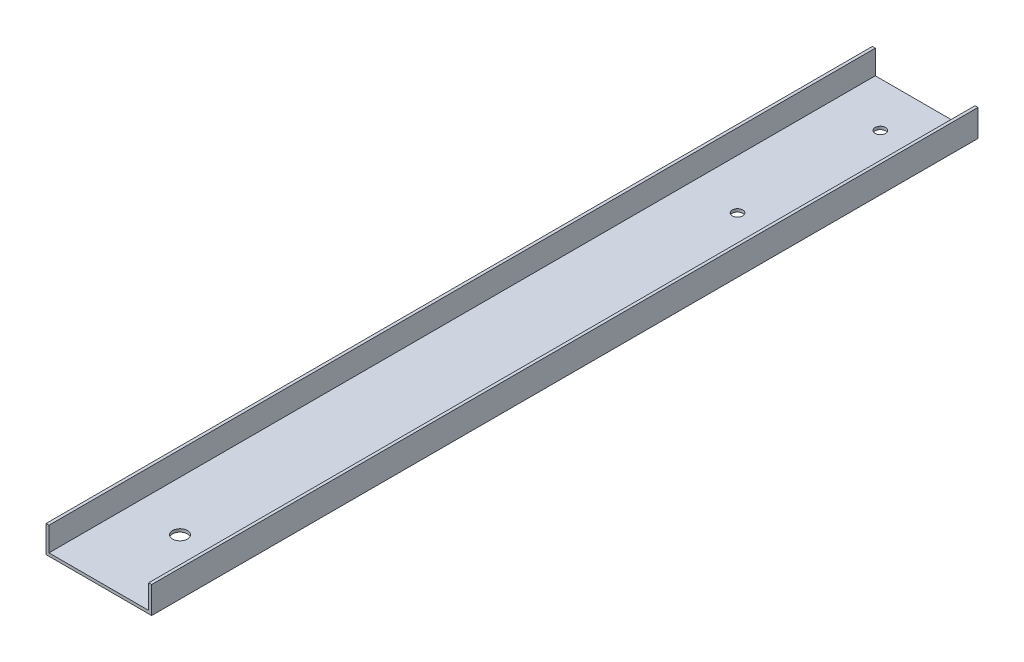
ISO-10303-21;
HEADER;
FILE_DESCRIPTION(('STEP AP214'),'2;1');
FILE_NAME('part.step','',(''),(''),'','','');
FILE_SCHEMA(('AUTOMOTIVE_DESIGN { 1 0 10303 214 1 1 1 1 }'));
ENDSEC;
DATA;
#1=APPLICATION_CONTEXT('core data for automotive mechanical design processes');
#2=APPLICATION_PROTOCOL_DEFINITION('international standard','automotive_design',2000,#1);
#3=PRODUCT_CONTEXT('',#1,'mechanical');
#4=PRODUCT('Part','Part','',(#3));
#5=PRODUCT_RELATED_PRODUCT_CATEGORY('part','',(#4));
#6=PRODUCT_DEFINITION_FORMATION('','',#4);
#7=PRODUCT_DEFINITION_CONTEXT('part definition',#1,'design');
#8=PRODUCT_DEFINITION('design','',#6,#7);
#9=PRODUCT_DEFINITION_SHAPE('','',#8);
#10=(LENGTH_UNIT() NAMED_UNIT(*) SI_UNIT(.MILLI.,.METRE.));
#11=(NAMED_UNIT(*) PLANE_ANGLE_UNIT() SI_UNIT($,.RADIAN.));
#12=(NAMED_UNIT(*) SI_UNIT($,.STERADIAN.) SOLID_ANGLE_UNIT());
#13=UNCERTAINTY_MEASURE_WITH_UNIT(LENGTH_MEASURE(1.E-05),#10,'distance_accuracy_value','');
#14=(GEOMETRIC_REPRESENTATION_CONTEXT(3) GLOBAL_UNCERTAINTY_ASSIGNED_CONTEXT((#13)) GLOBAL_UNIT_ASSIGNED_CONTEXT((#10,
#11,#12)) REPRESENTATION_CONTEXT('',''));
#15=CARTESIAN_POINT('',(0.,0.,0.));
#16=DIRECTION('',(0.,0.,1.));
#17=DIRECTION('',(1.,0.,0.));
#18=AXIS2_PLACEMENT_3D('',#15,#16,#17);
#19=CARTESIAN_POINT('',(1.27,0.,354.0125));
#20=DIRECTION('',(0.,-1.,0.));
#21=DIRECTION('',(0.,0.,-1.));
#22=AXIS2_PLACEMENT_3D('',#19,#20,#21);
#23=PLANE('',#22);
#24=DIRECTION('',(-1.,0.,0.));
#25=VECTOR('',#24,1.);
#26=CARTESIAN_POINT('',(1.27,0.,0.));
#27=LINE('',#26,#25);
#28=CARTESIAN_POINT('',(1.27,0.,0.));
#29=VERTEX_POINT('',#28);
#30=CARTESIAN_POINT('',(0.,0.,0.));
#31=VERTEX_POINT('',#30);
#32=EDGE_CURVE('E130',#29,#31,#27,.T.);
#33=ORIENTED_EDGE('',*,*,#32,.T.);
#34=DIRECTION('',(0.,0.,-1.));
#35=VECTOR('',#34,1.);
#36=CARTESIAN_POINT('',(0.,0.,354.0125));
#37=LINE('',#36,#35);
#38=CARTESIAN_POINT('',(0.,0.,354.0125));
#39=VERTEX_POINT('',#38);
#40=EDGE_CURVE('E11',#39,#31,#37,.T.);
#41=ORIENTED_EDGE('',*,*,#40,.F.);
#42=DIRECTION('',(-1.,0.,0.));
#43=VECTOR('',#42,1.);
#44=CARTESIAN_POINT('',(1.27,0.,354.0125));
#45=LINE('',#44,#43);
#46=CARTESIAN_POINT('',(1.27,0.,354.0125));
#47=VERTEX_POINT('',#46);
#48=EDGE_CURVE('E145',#47,#39,#45,.T.);
#49=ORIENTED_EDGE('',*,*,#48,.F.);
#50=DIRECTION('',(0.,0.,-1.));
#51=VECTOR('',#50,1.);
#52=CARTESIAN_POINT('',(1.27,0.,354.0125));
#53=LINE('',#52,#51);
#54=EDGE_CURVE('E126',#47,#29,#53,.T.);
#55=ORIENTED_EDGE('',*,*,#54,.T.);
#56=EDGE_LOOP('',(#33,#41,#49,#55));
#57=FACE_BOUND('',#56,.T.);
#58=ADVANCED_FACE('F34',(#57),#23,.F.);
#59=CARTESIAN_POINT('',(0.,0.,354.0125));
#60=DIRECTION('',(1.,0.,0.));
#61=DIRECTION('',(0.,1.,0.));
#62=AXIS2_PLACEMENT_3D('',#59,#60,#61);
#63=PLANE('',#62);
#64=DIRECTION('',(0.,-1.,0.));
#65=VECTOR('',#64,1.);
#66=CARTESIAN_POINT('',(0.,0.,0.));
#67=LINE('',#66,#65);
#68=CARTESIAN_POINT('',(0.,-11.5316,0.));
#69=VERTEX_POINT('',#68);
#70=EDGE_CURVE('E133',#31,#69,#67,.T.);
#71=ORIENTED_EDGE('',*,*,#70,.T.);
#72=DIRECTION('',(0.,0.,-1.));
#73=VECTOR('',#72,1.);
#74=CARTESIAN_POINT('',(0.,-11.5316,354.0125));
#75=LINE('',#74,#73);
#76=CARTESIAN_POINT('',(0.,-11.5316,354.0125));
#77=VERTEX_POINT('',#76);
#78=EDGE_CURVE('E42',#77,#69,#75,.T.);
#79=ORIENTED_EDGE('',*,*,#78,.F.);
#80=DIRECTION('',(0.,-1.,0.));
#81=VECTOR('',#80,1.);
#82=CARTESIAN_POINT('',(0.,0.,354.0125));
#83=LINE('',#82,#81);
#84=EDGE_CURVE('E93',#39,#77,#83,.T.);
#85=ORIENTED_EDGE('',*,*,#84,.F.);
#86=ORIENTED_EDGE('',*,*,#40,.T.);
#87=EDGE_LOOP('',(#71,#79,#85,#86));
#88=FACE_BOUND('',#87,.T.);
#89=ADVANCED_FACE('F207',(#88),#63,.F.);
#90=CARTESIAN_POINT('',(0.,-11.5316,354.0125));
#91=DIRECTION('',(0.,1.,0.));
#92=DIRECTION('',(-1.,0.,0.));
#93=AXIS2_PLACEMENT_3D('',#90,#91,#92);
#94=PLANE('',#93);
#95=CARTESIAN_POINT('',(22.6314,-11.5316,319.2145));
#96=DIRECTION('',(0.,-1.,0.));
#97=DIRECTION('',(0.,0.,-1.));
#98=AXIS2_PLACEMENT_3D('',#95,#96,#97);
#99=CIRCLE('',#98,3.175);
#100=CARTESIAN_POINT('',(22.6314,-11.5316,316.0395));
#101=VERTEX_POINT('',#100);
#102=EDGE_CURVE('E190',#101,#101,#99,.T.);
#103=ORIENTED_EDGE('',*,*,#102,.F.);
#104=EDGE_LOOP('',(#103));
#105=FACE_BOUND('',#104,.T.);
#106=CARTESIAN_POINT('',(22.6314,-11.5316,80.391));
#107=DIRECTION('',(0.,-1.,0.));
#108=DIRECTION('',(0.,0.,-1.));
#109=AXIS2_PLACEMENT_3D('',#106,#107,#108);
#110=CIRCLE('',#109,2.2225);
#111=CARTESIAN_POINT('',(22.6314,-11.5316,78.1685));
#112=VERTEX_POINT('',#111);
#113=EDGE_CURVE('E184',#112,#112,#110,.T.);
#114=ORIENTED_EDGE('',*,*,#113,.F.);
#115=EDGE_LOOP('',(#114));
#116=FACE_BOUND('',#115,.T.);
#117=CARTESIAN_POINT('',(22.6314,-11.5316,19.1897));
#118=DIRECTION('',(0.,-1.,0.));
#119=DIRECTION('',(0.,0.,-1.));
#120=AXIS2_PLACEMENT_3D('',#117,#118,#119);
#121=CIRCLE('',#120,2.2225);
#122=CARTESIAN_POINT('',(22.6314,-11.5316,16.9672));
#123=VERTEX_POINT('',#122);
#124=EDGE_CURVE('E178',#123,#123,#121,.T.);
#125=ORIENTED_EDGE('',*,*,#124,.F.);
#126=EDGE_LOOP('',(#125));
#127=FACE_BOUND('',#126,.T.);
#128=DIRECTION('',(1.,0.,0.));
#129=VECTOR('',#128,1.);
#130=CARTESIAN_POINT('',(0.,-11.5316,0.));
#131=LINE('',#130,#129);
#132=CARTESIAN_POINT('',(45.2628,-11.5316,0.));
#133=VERTEX_POINT('',#132);
#134=EDGE_CURVE('E136',#69,#133,#131,.T.);
#135=ORIENTED_EDGE('',*,*,#134,.T.);
#136=DIRECTION('',(0.,0.,-1.));
#137=VECTOR('',#136,1.);
#138=CARTESIAN_POINT('',(45.2628,-11.5316,354.0125));
#139=LINE('',#138,#137);
#140=CARTESIAN_POINT('',(45.2628,-11.5316,354.0125));
#141=VERTEX_POINT('',#140);
#142=EDGE_CURVE('E152',#141,#133,#139,.T.);
#143=ORIENTED_EDGE('',*,*,#142,.F.);
#144=DIRECTION('',(1.,0.,0.));
#145=VECTOR('',#144,1.);
#146=CARTESIAN_POINT('',(0.,-11.5316,354.0125));
#147=LINE('',#146,#145);
#148=EDGE_CURVE('E160',#77,#141,#147,.T.);
#149=ORIENTED_EDGE('',*,*,#148,.F.);
#150=ORIENTED_EDGE('',*,*,#78,.T.);
#151=EDGE_LOOP('',(#135,#143,#149,#150));
#152=FACE_BOUND('',#151,.T.);
#153=ADVANCED_FACE('F158',(#105,#116,#127,#152),#94,.F.);
#154=CARTESIAN_POINT('',(45.2628,-11.5316,354.0125));
#155=DIRECTION('',(-1.,0.,0.));
#156=DIRECTION('',(0.,-1.,0.));
#157=AXIS2_PLACEMENT_3D('',#154,#155,#156);
#158=PLANE('',#157);
#159=DIRECTION('',(0.,1.,0.));
#160=VECTOR('',#159,1.);
#161=CARTESIAN_POINT('',(45.2628,-11.5316,0.));
#162=LINE('',#161,#160);
#163=CARTESIAN_POINT('',(45.2628,0.,0.));
#164=VERTEX_POINT('',#163);
#165=EDGE_CURVE('E138',#133,#164,#162,.T.);
#166=ORIENTED_EDGE('',*,*,#165,.T.);
#167=DIRECTION('',(0.,0.,-1.));
#168=VECTOR('',#167,1.);
#169=CARTESIAN_POINT('',(45.2628,0.,354.0125));
#170=LINE('',#169,#168);
#171=CARTESIAN_POINT('',(45.2628,0.,354.0125));
#172=VERTEX_POINT('',#171);
#173=EDGE_CURVE('E149',#172,#164,#170,.T.);
#174=ORIENTED_EDGE('',*,*,#173,.F.);
#175=DIRECTION('',(0.,1.,0.));
#176=VECTOR('',#175,1.);
#177=CARTESIAN_POINT('',(45.2628,-11.5316,354.0125));
#178=LINE('',#177,#176);
#179=EDGE_CURVE('E172',#141,#172,#178,.T.);
#180=ORIENTED_EDGE('',*,*,#179,.F.);
#181=ORIENTED_EDGE('',*,*,#142,.T.);
#182=EDGE_LOOP('',(#166,#174,#180,#181));
#183=FACE_BOUND('',#182,.T.);
#184=ADVANCED_FACE('F168',(#183),#158,.F.);
#185=CARTESIAN_POINT('',(45.2628,0.,354.0125));
#186=DIRECTION('',(0.,-1.,0.));
#187=DIRECTION('',(1.,0.,0.));
#188=AXIS2_PLACEMENT_3D('',#185,#186,#187);
#189=PLANE('',#188);
#190=DIRECTION('',(-1.,0.,0.));
#191=VECTOR('',#190,1.);
#192=CARTESIAN_POINT('',(45.2628,0.,0.));
#193=LINE('',#192,#191);
#194=CARTESIAN_POINT('',(43.9928,0.,0.));
#195=VERTEX_POINT('',#194);
#196=EDGE_CURVE('E140',#164,#195,#193,.T.);
#197=ORIENTED_EDGE('',*,*,#196,.T.);
#198=DIRECTION('',(0.,0.,-1.));
#199=VECTOR('',#198,1.);
#200=CARTESIAN_POINT('',(43.9928,0.,354.0125));
#201=LINE('',#200,#199);
#202=CARTESIAN_POINT('',(43.9928,0.,354.0125));
#203=VERTEX_POINT('',#202);
#204=EDGE_CURVE('E121',#203,#195,#201,.T.);
#205=ORIENTED_EDGE('',*,*,#204,.F.);
#206=DIRECTION('',(-1.,0.,0.));
#207=VECTOR('',#206,1.);
#208=CARTESIAN_POINT('',(45.2628,0.,354.0125));
#209=LINE('',#208,#207);
#210=EDGE_CURVE('E112',#172,#203,#209,.T.);
#211=ORIENTED_EDGE('',*,*,#210,.F.);
#212=ORIENTED_EDGE('',*,*,#173,.T.);
#213=EDGE_LOOP('',(#197,#205,#211,#212));
#214=FACE_BOUND('',#213,.T.);
#215=ADVANCED_FACE('F171',(#214),#189,.F.);
#216=CARTESIAN_POINT('',(43.9928,0.,354.0125));
#217=DIRECTION('',(1.,0.,0.));
#218=DIRECTION('',(0.,0.,-1.));
#219=AXIS2_PLACEMENT_3D('',#216,#217,#218);
#220=PLANE('',#219);
#221=DIRECTION('',(0.,-1.,0.));
#222=VECTOR('',#221,1.);
#223=CARTESIAN_POINT('',(43.9928,0.,0.));
#224=LINE('',#223,#222);
#225=CARTESIAN_POINT('',(43.9928,-10.2616,0.));
#226=VERTEX_POINT('',#225);
#227=EDGE_CURVE('E120',#195,#226,#224,.T.);
#228=ORIENTED_EDGE('',*,*,#227,.T.);
#229=DIRECTION('',(0.,0.,-1.));
#230=VECTOR('',#229,1.);
#231=CARTESIAN_POINT('',(43.9928,-10.2616,354.0125));
#232=LINE('',#231,#230);
#233=CARTESIAN_POINT('',(43.9928,-10.2616,354.0125));
#234=VERTEX_POINT('',#233);
#235=EDGE_CURVE('E117',#234,#226,#232,.T.);
#236=ORIENTED_EDGE('',*,*,#235,.F.);
#237=DIRECTION('',(0.,-1.,0.));
#238=VECTOR('',#237,1.);
#239=CARTESIAN_POINT('',(43.9928,0.,354.0125));
#240=LINE('',#239,#238);
#241=EDGE_CURVE('E106',#203,#234,#240,.T.);
#242=ORIENTED_EDGE('',*,*,#241,.F.);
#243=ORIENTED_EDGE('',*,*,#204,.T.);
#244=EDGE_LOOP('',(#228,#236,#242,#243));
#245=FACE_BOUND('',#244,.T.);
#246=ADVANCED_FACE('F118',(#245),#220,.F.);
#247=CARTESIAN_POINT('',(43.9928,-10.2616,354.0125));
#248=DIRECTION('',(0.,-1.,0.));
#249=DIRECTION('',(1.,0.,0.));
#250=AXIS2_PLACEMENT_3D('',#247,#248,#249);
#251=PLANE('',#250);
#252=CARTESIAN_POINT('',(22.6314,-10.2616,319.2145));
#253=DIRECTION('',(0.,-1.,0.));
#254=DIRECTION('',(0.,0.,-1.));
#255=AXIS2_PLACEMENT_3D('',#252,#253,#254);
#256=CIRCLE('',#255,3.175);
#257=CARTESIAN_POINT('',(22.6314,-10.2616,316.0395));
#258=VERTEX_POINT('',#257);
#259=EDGE_CURVE('E187',#258,#258,#256,.T.);
#260=ORIENTED_EDGE('',*,*,#259,.T.);
#261=EDGE_LOOP('',(#260));
#262=FACE_BOUND('',#261,.T.);
#263=CARTESIAN_POINT('',(22.6314,-10.2616,80.391));
#264=DIRECTION('',(0.,-1.,0.));
#265=DIRECTION('',(0.,0.,-1.));
#266=AXIS2_PLACEMENT_3D('',#263,#264,#265);
#267=CIRCLE('',#266,2.2225);
#268=CARTESIAN_POINT('',(22.6314,-10.2616,78.1685));
#269=VERTEX_POINT('',#268);
#270=EDGE_CURVE('E181',#269,#269,#267,.T.);
#271=ORIENTED_EDGE('',*,*,#270,.T.);
#272=EDGE_LOOP('',(#271));
#273=FACE_BOUND('',#272,.T.);
#274=CARTESIAN_POINT('',(22.6314,-10.2616,19.1897));
#275=DIRECTION('',(0.,-1.,0.));
#276=DIRECTION('',(0.,0.,-1.));
#277=AXIS2_PLACEMENT_3D('',#274,#275,#276);
#278=CIRCLE('',#277,2.2225);
#279=CARTESIAN_POINT('',(22.6314,-10.2616,16.9672));
#280=VERTEX_POINT('',#279);
#281=EDGE_CURVE('E134',#280,#280,#278,.T.);
#282=ORIENTED_EDGE('',*,*,#281,.T.);
#283=EDGE_LOOP('',(#282));
#284=FACE_BOUND('',#283,.T.);
#285=DIRECTION('',(-1.,0.,0.));
#286=VECTOR('',#285,1.);
#287=CARTESIAN_POINT('',(43.9928,-10.2616,0.));
#288=LINE('',#287,#286);
#289=CARTESIAN_POINT('',(1.27,-10.2616,0.));
#290=VERTEX_POINT('',#289);
#291=EDGE_CURVE('E79',#226,#290,#288,.T.);
#292=ORIENTED_EDGE('',*,*,#291,.T.);
#293=DIRECTION('',(0.,0.,-1.));
#294=VECTOR('',#293,1.);
#295=CARTESIAN_POINT('',(1.27,-10.2616,354.0125));
#296=LINE('',#295,#294);
#297=CARTESIAN_POINT('',(1.27,-10.2616,354.0125));
#298=VERTEX_POINT('',#297);
#299=EDGE_CURVE('E122',#298,#290,#296,.T.);
#300=ORIENTED_EDGE('',*,*,#299,.F.);
#301=DIRECTION('',(-1.,0.,0.));
#302=VECTOR('',#301,1.);
#303=CARTESIAN_POINT('',(43.9928,-10.2616,354.0125));
#304=LINE('',#303,#302);
#305=EDGE_CURVE('E110',#234,#298,#304,.T.);
#306=ORIENTED_EDGE('',*,*,#305,.F.);
#307=ORIENTED_EDGE('',*,*,#235,.T.);
#308=EDGE_LOOP('',(#292,#300,#306,#307));
#309=FACE_BOUND('',#308,.T.);
#310=ADVANCED_FACE('F124',(#262,#273,#284,#309),#251,.F.);
#311=CARTESIAN_POINT('',(1.27,-10.2616,354.0125));
#312=DIRECTION('',(-1.,0.,0.));
#313=DIRECTION('',(0.,-1.,0.));
#314=AXIS2_PLACEMENT_3D('',#311,#312,#313);
#315=PLANE('',#314);
#316=DIRECTION('',(0.,1.,0.));
#317=VECTOR('',#316,1.);
#318=CARTESIAN_POINT('',(1.27,-10.2616,0.));
#319=LINE('',#318,#317);
#320=EDGE_CURVE('E85',#290,#29,#319,.T.);
#321=ORIENTED_EDGE('',*,*,#320,.T.);
#322=ORIENTED_EDGE('',*,*,#54,.F.);
#323=DIRECTION('',(0.,1.,0.));
#324=VECTOR('',#323,1.);
#325=CARTESIAN_POINT('',(1.27,-10.2616,354.0125));
#326=LINE('',#325,#324);
#327=EDGE_CURVE('E50',#298,#47,#326,.T.);
#328=ORIENTED_EDGE('',*,*,#327,.F.);
#329=ORIENTED_EDGE('',*,*,#299,.T.);
#330=EDGE_LOOP('',(#321,#322,#328,#329));
#331=FACE_BOUND('',#330,.T.);
#332=ADVANCED_FACE('F233',(#331),#315,.F.);
#333=CARTESIAN_POINT('',(0.,0.,354.0125));
#334=DIRECTION('',(0.,0.,1.));
#335=DIRECTION('',(1.,0.,0.));
#336=AXIS2_PLACEMENT_3D('',#333,#334,#335);
#337=PLANE('',#336);
#338=ORIENTED_EDGE('',*,*,#48,.T.);
#339=ORIENTED_EDGE('',*,*,#84,.T.);
#340=ORIENTED_EDGE('',*,*,#148,.T.);
#341=ORIENTED_EDGE('',*,*,#179,.T.);
#342=ORIENTED_EDGE('',*,*,#210,.T.);
#343=ORIENTED_EDGE('',*,*,#241,.T.);
#344=ORIENTED_EDGE('',*,*,#305,.T.);
#345=ORIENTED_EDGE('',*,*,#327,.T.);
#346=EDGE_LOOP('',(#338,#339,#340,#341,#342,#343,#344,#345));
#347=FACE_BOUND('',#346,.T.);
#348=ADVANCED_FACE('F108',(#347),#337,.T.);
#349=CARTESIAN_POINT('',(0.,0.,0.));
#350=DIRECTION('',(0.,0.,1.));
#351=DIRECTION('',(1.,0.,0.));
#352=AXIS2_PLACEMENT_3D('',#349,#350,#351);
#353=PLANE('',#352);
#354=ORIENTED_EDGE('',*,*,#32,.F.);
#355=ORIENTED_EDGE('',*,*,#320,.F.);
#356=ORIENTED_EDGE('',*,*,#291,.F.);
#357=ORIENTED_EDGE('',*,*,#227,.F.);
#358=ORIENTED_EDGE('',*,*,#196,.F.);
#359=ORIENTED_EDGE('',*,*,#165,.F.);
#360=ORIENTED_EDGE('',*,*,#134,.F.);
#361=ORIENTED_EDGE('',*,*,#70,.F.);
#362=EDGE_LOOP('',(#354,#355,#356,#357,#358,#359,#360,#361));
#363=FACE_BOUND('',#362,.T.);
#364=ADVANCED_FACE('F164',(#363),#353,.F.);
#365=CARTESIAN_POINT('',(22.6314,-10.2616,19.1897));
#366=DIRECTION('',(0.,-1.,0.));
#367=DIRECTION('',(0.,0.,-1.));
#368=AXIS2_PLACEMENT_3D('',#365,#366,#367);
#369=CYLINDRICAL_SURFACE('',#368,2.2225);
#370=ORIENTED_EDGE('',*,*,#281,.F.);
#371=EDGE_LOOP('',(#370));
#372=FACE_BOUND('',#371,.T.);
#373=ORIENTED_EDGE('',*,*,#124,.T.);
#374=EDGE_LOOP('',(#373));
#375=FACE_BOUND('',#374,.T.);
#376=ADVANCED_FACE('F213',(#372,#375),#369,.F.);
#377=CARTESIAN_POINT('',(22.6314,-10.2616,80.391));
#378=DIRECTION('',(0.,-1.,0.));
#379=DIRECTION('',(0.,0.,-1.));
#380=AXIS2_PLACEMENT_3D('',#377,#378,#379);
#381=CYLINDRICAL_SURFACE('',#380,2.2225);
#382=ORIENTED_EDGE('',*,*,#270,.F.);
#383=EDGE_LOOP('',(#382));
#384=FACE_BOUND('',#383,.T.);
#385=ORIENTED_EDGE('',*,*,#113,.T.);
#386=EDGE_LOOP('',(#385));
#387=FACE_BOUND('',#386,.T.);
#388=ADVANCED_FACE('F201',(#384,#387),#381,.F.);
#389=CARTESIAN_POINT('',(22.6314,-10.2616,319.2145));
#390=DIRECTION('',(0.,-1.,0.));
#391=DIRECTION('',(0.,0.,-1.));
#392=AXIS2_PLACEMENT_3D('',#389,#390,#391);
#393=CYLINDRICAL_SURFACE('',#392,3.175);
#394=ORIENTED_EDGE('',*,*,#259,.F.);
#395=EDGE_LOOP('',(#394));
#396=FACE_BOUND('',#395,.T.);
#397=ORIENTED_EDGE('',*,*,#102,.T.);
#398=EDGE_LOOP('',(#397));
#399=FACE_BOUND('',#398,.T.);
#400=ADVANCED_FACE('F198',(#396,#399),#393,.F.);
#401=CLOSED_SHELL('',(#58,#89,#153,#184,#215,#246,#310,#332,#348,#364,#376,#388,#400));
#402=MANIFOLD_SOLID_BREP('B2',#401);
#403=ADVANCED_BREP_SHAPE_REPRESENTATION('',(#18,#402),#14);
#404=SHAPE_DEFINITION_REPRESENTATION(#9,#403);
ENDSEC;
END-ISO-10303-21;
